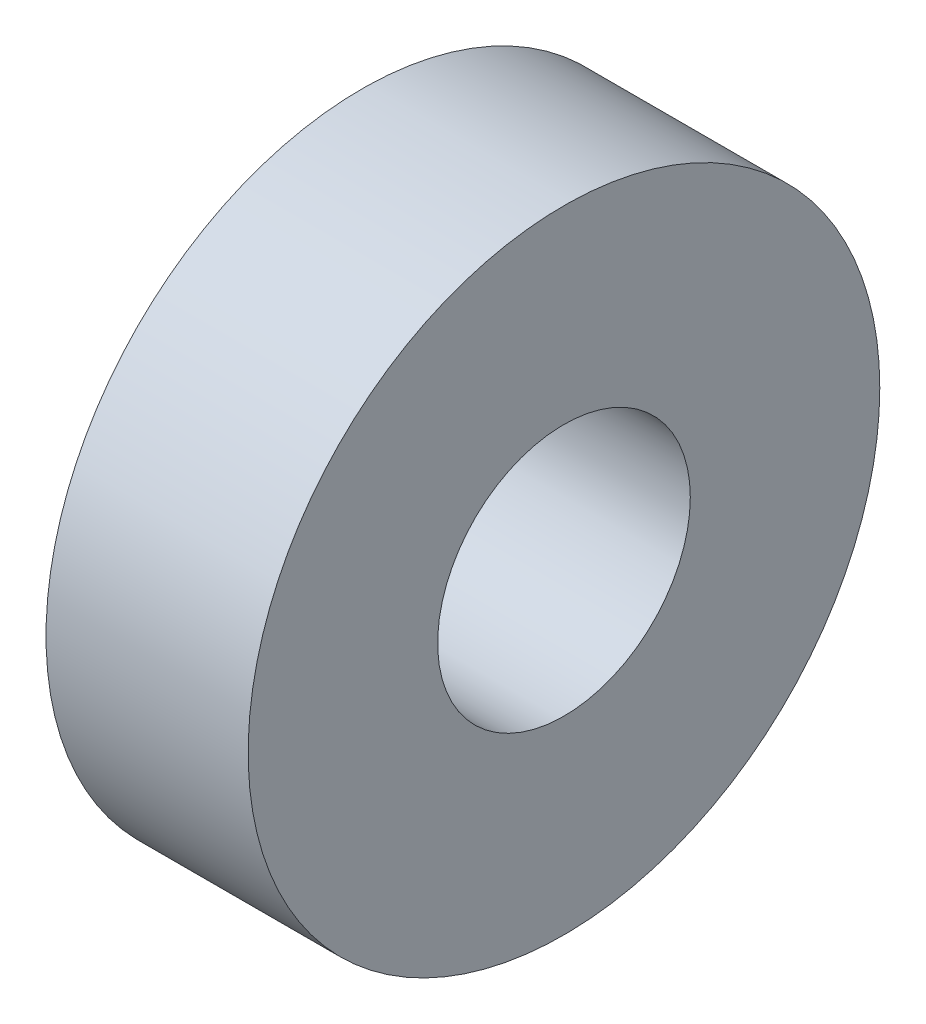
ISO-10303-21;
HEADER;
FILE_DESCRIPTION(('STEP AP214'),'2;1');
FILE_NAME('part.step','',(''),(''),'','','');
FILE_SCHEMA(('AUTOMOTIVE_DESIGN { 1 0 10303 214 1 1 1 1 }'));
ENDSEC;
DATA;
#1=APPLICATION_CONTEXT('core data for automotive mechanical design processes');
#2=APPLICATION_PROTOCOL_DEFINITION('international standard','automotive_design',2000,#1);
#3=PRODUCT_CONTEXT('',#1,'mechanical');
#4=PRODUCT('Part','Part','',(#3));
#5=PRODUCT_RELATED_PRODUCT_CATEGORY('part','',(#4));
#6=PRODUCT_DEFINITION_FORMATION('','',#4);
#7=PRODUCT_DEFINITION_CONTEXT('part definition',#1,'design');
#8=PRODUCT_DEFINITION('design','',#6,#7);
#9=PRODUCT_DEFINITION_SHAPE('','',#8);
#10=(LENGTH_UNIT() NAMED_UNIT(*) SI_UNIT(.MILLI.,.METRE.));
#11=(NAMED_UNIT(*) PLANE_ANGLE_UNIT() SI_UNIT($,.RADIAN.));
#12=(NAMED_UNIT(*) SI_UNIT($,.STERADIAN.) SOLID_ANGLE_UNIT());
#13=UNCERTAINTY_MEASURE_WITH_UNIT(LENGTH_MEASURE(1.E-05),#10,'distance_accuracy_value','');
#14=(GEOMETRIC_REPRESENTATION_CONTEXT(3) GLOBAL_UNCERTAINTY_ASSIGNED_CONTEXT((#13)) GLOBAL_UNIT_ASSIGNED_CONTEXT((#10,
#11,#12)) REPRESENTATION_CONTEXT('',''));
#15=CARTESIAN_POINT('',(0.,0.,0.));
#16=DIRECTION('',(0.,0.,1.));
#17=DIRECTION('',(1.,0.,0.));
#18=AXIS2_PLACEMENT_3D('',#15,#16,#17);
#19=CARTESIAN_POINT('',(16.,0.,0.));
#20=DIRECTION('',(1.,0.,0.));
#21=DIRECTION('',(0.,0.,-1.));
#22=AXIS2_PLACEMENT_3D('',#19,#20,#21);
#23=PLANE('',#22);
#24=CARTESIAN_POINT('',(16.,0.,0.));
#25=DIRECTION('',(1.,0.,0.));
#26=DIRECTION('',(0.,0.,-1.));
#27=AXIS2_PLACEMENT_3D('',#24,#25,#26);
#28=CIRCLE('',#27,25.);
#29=CARTESIAN_POINT('',(16.,0.,-25.));
#30=VERTEX_POINT('',#29);
#31=EDGE_CURVE('E10',#30,#30,#28,.T.);
#32=ORIENTED_EDGE('',*,*,#31,.T.);
#33=EDGE_LOOP('',(#32));
#34=FACE_BOUND('',#33,.T.);
#35=CARTESIAN_POINT('',(16.,0.,0.));
#36=DIRECTION('',(1.,0.,0.));
#37=DIRECTION('',(0.,0.,-1.));
#38=AXIS2_PLACEMENT_3D('',#35,#36,#37);
#39=CIRCLE('',#38,10.);
#40=CARTESIAN_POINT('',(16.,0.,-10.));
#41=VERTEX_POINT('',#40);
#42=EDGE_CURVE('E50',#41,#41,#39,.T.);
#43=ORIENTED_EDGE('',*,*,#42,.F.);
#44=EDGE_LOOP('',(#43));
#45=FACE_BOUND('',#44,.T.);
#46=ADVANCED_FACE('F37',(#34,#45),#23,.T.);
#47=CARTESIAN_POINT('',(0.,0.,0.));
#48=DIRECTION('',(1.,0.,0.));
#49=DIRECTION('',(0.,0.,-1.));
#50=AXIS2_PLACEMENT_3D('',#47,#48,#49);
#51=PLANE('',#50);
#52=CARTESIAN_POINT('',(0.,0.,0.));
#53=DIRECTION('',(1.,0.,0.));
#54=DIRECTION('',(0.,0.,-1.));
#55=AXIS2_PLACEMENT_3D('',#52,#53,#54);
#56=CIRCLE('',#55,25.);
#57=CARTESIAN_POINT('',(0.,0.,-25.));
#58=VERTEX_POINT('',#57);
#59=EDGE_CURVE('E41',#58,#58,#56,.T.);
#60=ORIENTED_EDGE('',*,*,#59,.F.);
#61=EDGE_LOOP('',(#60));
#62=FACE_BOUND('',#61,.T.);
#63=CARTESIAN_POINT('',(0.,0.,0.));
#64=DIRECTION('',(1.,0.,0.));
#65=DIRECTION('',(0.,0.,-1.));
#66=AXIS2_PLACEMENT_3D('',#63,#64,#65);
#67=CIRCLE('',#66,10.);
#68=CARTESIAN_POINT('',(0.,0.,-10.));
#69=VERTEX_POINT('',#68);
#70=EDGE_CURVE('E52',#69,#69,#67,.T.);
#71=ORIENTED_EDGE('',*,*,#70,.T.);
#72=EDGE_LOOP('',(#71));
#73=FACE_BOUND('',#72,.T.);
#74=ADVANCED_FACE('F64',(#62,#73),#51,.F.);
#75=CARTESIAN_POINT('',(16.,0.,0.));
#76=DIRECTION('',(-1.,0.,0.));
#77=DIRECTION('',(0.,0.,1.));
#78=AXIS2_PLACEMENT_3D('',#75,#76,#77);
#79=CYLINDRICAL_SURFACE('',#78,25.);
#80=ORIENTED_EDGE('',*,*,#31,.F.);
#81=EDGE_LOOP('',(#80));
#82=FACE_BOUND('',#81,.T.);
#83=ORIENTED_EDGE('',*,*,#59,.T.);
#84=EDGE_LOOP('',(#83));
#85=FACE_BOUND('',#84,.T.);
#86=ADVANCED_FACE('F39',(#82,#85),#79,.T.);
#87=CARTESIAN_POINT('',(16.,0.,0.));
#88=DIRECTION('',(-1.,0.,0.));
#89=DIRECTION('',(0.,0.,1.));
#90=AXIS2_PLACEMENT_3D('',#87,#88,#89);
#91=CYLINDRICAL_SURFACE('',#90,10.);
#92=ORIENTED_EDGE('',*,*,#42,.T.);
#93=EDGE_LOOP('',(#92));
#94=FACE_BOUND('',#93,.T.);
#95=ORIENTED_EDGE('',*,*,#70,.F.);
#96=EDGE_LOOP('',(#95));
#97=FACE_BOUND('',#96,.T.);
#98=ADVANCED_FACE('F60',(#94,#97),#91,.F.);
#99=CLOSED_SHELL('',(#46,#74,#86,#98));
#100=MANIFOLD_SOLID_BREP('B2',#99);
#101=ADVANCED_BREP_SHAPE_REPRESENTATION('',(#18,#100),#14);
#102=SHAPE_DEFINITION_REPRESENTATION(#9,#101);
ENDSEC;
END-ISO-10303-21;
